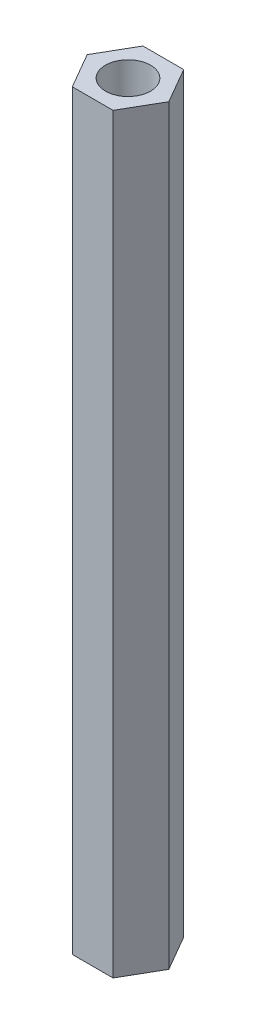
ISO-10303-21;
HEADER;
FILE_DESCRIPTION(('STEP AP214'),'2;1');
FILE_NAME('part.step','',(''),(''),'','','');
FILE_SCHEMA(('AUTOMOTIVE_DESIGN { 1 0 10303 214 1 1 1 1 }'));
ENDSEC;
DATA;
#1=APPLICATION_CONTEXT('core data for automotive mechanical design processes');
#2=APPLICATION_PROTOCOL_DEFINITION('international standard','automotive_design',2000,#1);
#3=PRODUCT_CONTEXT('',#1,'mechanical');
#4=PRODUCT('Part','Part','',(#3));
#5=PRODUCT_RELATED_PRODUCT_CATEGORY('part','',(#4));
#6=PRODUCT_DEFINITION_FORMATION('','',#4);
#7=PRODUCT_DEFINITION_CONTEXT('part definition',#1,'design');
#8=PRODUCT_DEFINITION('design','',#6,#7);
#9=PRODUCT_DEFINITION_SHAPE('','',#8);
#10=(LENGTH_UNIT() NAMED_UNIT(*) SI_UNIT(.MILLI.,.METRE.));
#11=(NAMED_UNIT(*) PLANE_ANGLE_UNIT() SI_UNIT($,.RADIAN.));
#12=(NAMED_UNIT(*) SI_UNIT($,.STERADIAN.) SOLID_ANGLE_UNIT());
#13=UNCERTAINTY_MEASURE_WITH_UNIT(LENGTH_MEASURE(1.E-05),#10,'distance_accuracy_value','');
#14=(GEOMETRIC_REPRESENTATION_CONTEXT(3) GLOBAL_UNCERTAINTY_ASSIGNED_CONTEXT((#13)) GLOBAL_UNIT_ASSIGNED_CONTEXT((#10,
#11,#12)) REPRESENTATION_CONTEXT('',''));
#15=CARTESIAN_POINT('',(0.,0.,0.));
#16=DIRECTION('',(0.,0.,1.));
#17=DIRECTION('',(1.,0.,0.));
#18=AXIS2_PLACEMENT_3D('',#15,#16,#17);
#19=CARTESIAN_POINT('',(0.,50.,0.));
#20=DIRECTION('',(0.,1.,0.));
#21=DIRECTION('',(0.,0.,1.));
#22=AXIS2_PLACEMENT_3D('',#19,#20,#21);
#23=PLANE('',#22);
#24=DIRECTION('',(0.499999999999985,0.,-0.866025403784447));
#25=VECTOR('',#24,1.);
#26=CARTESIAN_POINT('',(1.35677313259566,50.,2.35000000000002));
#27=LINE('',#26,#25);
#28=CARTESIAN_POINT('',(1.35677313259566,50.,2.35000000000002));
#29=VERTEX_POINT('',#28);
#30=CARTESIAN_POINT('',(2.71354626519124,50.,0.));
#31=VERTEX_POINT('',#30);
#32=EDGE_CURVE('E128',#29,#31,#27,.T.);
#33=ORIENTED_EDGE('',*,*,#32,.T.);
#34=DIRECTION('',(-0.500000000000015,0.,-0.86602540378443));
#35=VECTOR('',#34,1.);
#36=CARTESIAN_POINT('',(2.71354626519124,50.,0.));
#37=LINE('',#36,#35);
#38=CARTESIAN_POINT('',(1.35677313259558,50.,-2.34999999999998));
#39=VERTEX_POINT('',#38);
#40=EDGE_CURVE('E86',#31,#39,#37,.T.);
#41=ORIENTED_EDGE('',*,*,#40,.T.);
#42=DIRECTION('',(-1.,0.,0.));
#43=VECTOR('',#42,1.);
#44=CARTESIAN_POINT('',(1.35677313259558,50.,-2.34999999999998));
#45=LINE('',#44,#43);
#46=CARTESIAN_POINT('',(-1.35677313259566,50.,-2.34999999999994));
#47=VERTEX_POINT('',#46);
#48=EDGE_CURVE('E99',#39,#47,#45,.T.);
#49=ORIENTED_EDGE('',*,*,#48,.T.);
#50=DIRECTION('',(-0.499999999999985,0.,0.866025403784447));
#51=VECTOR('',#50,1.);
#52=CARTESIAN_POINT('',(-1.35677313259566,50.,-2.34999999999994));
#53=LINE('',#52,#51);
#54=CARTESIAN_POINT('',(-2.71354626519124,50.,0.));
#55=VERTEX_POINT('',#54);
#56=EDGE_CURVE('E93',#47,#55,#53,.T.);
#57=ORIENTED_EDGE('',*,*,#56,.T.);
#58=DIRECTION('',(0.500000000000015,0.,0.86602540378443));
#59=VECTOR('',#58,1.);
#60=CARTESIAN_POINT('',(-2.71354626519124,50.,0.));
#61=LINE('',#60,#59);
#62=CARTESIAN_POINT('',(-1.35677313259558,50.,2.35000000000006));
#63=VERTEX_POINT('',#62);
#64=EDGE_CURVE('E97',#55,#63,#61,.T.);
#65=ORIENTED_EDGE('',*,*,#64,.T.);
#66=DIRECTION('',(1.,0.,0.));
#67=VECTOR('',#66,1.);
#68=CARTESIAN_POINT('',(-1.35677313259558,50.,2.35000000000006));
#69=LINE('',#68,#67);
#70=EDGE_CURVE('E49',#63,#29,#69,.T.);
#71=ORIENTED_EDGE('',*,*,#70,.T.);
#72=EDGE_LOOP('',(#33,#41,#49,#57,#65,#71));
#73=FACE_BOUND('',#72,.T.);
#74=CARTESIAN_POINT('',(0.,50.,0.));
#75=DIRECTION('',(0.,1.,0.));
#76=DIRECTION('',(0.,0.,1.));
#77=AXIS2_PLACEMENT_3D('',#74,#75,#76);
#78=CIRCLE('',#77,1.5);
#79=CARTESIAN_POINT('',(0.,50.,1.5));
#80=VERTEX_POINT('',#79);
#81=EDGE_CURVE('E121',#80,#80,#78,.T.);
#82=ORIENTED_EDGE('',*,*,#81,.F.);
#83=EDGE_LOOP('',(#82));
#84=FACE_BOUND('',#83,.T.);
#85=ADVANCED_FACE('F32',(#73,#84),#23,.T.);
#86=CARTESIAN_POINT('',(0.,0.,0.));
#87=DIRECTION('',(0.,1.,0.));
#88=DIRECTION('',(0.,0.,1.));
#89=AXIS2_PLACEMENT_3D('',#86,#87,#88);
#90=PLANE('',#89);
#91=DIRECTION('',(0.499999999999985,0.,-0.866025403784447));
#92=VECTOR('',#91,1.);
#93=CARTESIAN_POINT('',(1.35677313259566,0.,2.35000000000002));
#94=LINE('',#93,#92);
#95=CARTESIAN_POINT('',(1.35677313259566,0.,2.35000000000002));
#96=VERTEX_POINT('',#95);
#97=CARTESIAN_POINT('',(2.71354626519124,0.,0.));
#98=VERTEX_POINT('',#97);
#99=EDGE_CURVE('E117',#96,#98,#94,.T.);
#100=ORIENTED_EDGE('',*,*,#99,.F.);
#101=DIRECTION('',(1.,0.,0.));
#102=VECTOR('',#101,1.);
#103=CARTESIAN_POINT('',(-1.35677313259558,0.,2.35000000000006));
#104=LINE('',#103,#102);
#105=CARTESIAN_POINT('',(-1.35677313259558,0.,2.35000000000006));
#106=VERTEX_POINT('',#105);
#107=EDGE_CURVE('E78',#106,#96,#104,.T.);
#108=ORIENTED_EDGE('',*,*,#107,.F.);
#109=DIRECTION('',(0.500000000000015,0.,0.86602540378443));
#110=VECTOR('',#109,1.);
#111=CARTESIAN_POINT('',(-2.71354626519124,0.,0.));
#112=LINE('',#111,#110);
#113=CARTESIAN_POINT('',(-2.71354626519124,0.,0.));
#114=VERTEX_POINT('',#113);
#115=EDGE_CURVE('E72',#114,#106,#112,.T.);
#116=ORIENTED_EDGE('',*,*,#115,.F.);
#117=DIRECTION('',(-0.499999999999985,0.,0.866025403784447));
#118=VECTOR('',#117,1.);
#119=CARTESIAN_POINT('',(-1.35677313259566,0.,-2.34999999999994));
#120=LINE('',#119,#118);
#121=CARTESIAN_POINT('',(-1.35677313259566,0.,-2.34999999999994));
#122=VERTEX_POINT('',#121);
#123=EDGE_CURVE('E107',#122,#114,#120,.T.);
#124=ORIENTED_EDGE('',*,*,#123,.F.);
#125=DIRECTION('',(-1.,0.,0.));
#126=VECTOR('',#125,1.);
#127=CARTESIAN_POINT('',(1.35677313259558,0.,-2.34999999999998));
#128=LINE('',#127,#126);
#129=CARTESIAN_POINT('',(1.35677313259558,0.,-2.34999999999998));
#130=VERTEX_POINT('',#129);
#131=EDGE_CURVE('E123',#130,#122,#128,.T.);
#132=ORIENTED_EDGE('',*,*,#131,.F.);
#133=DIRECTION('',(-0.500000000000015,0.,-0.86602540378443));
#134=VECTOR('',#133,1.);
#135=CARTESIAN_POINT('',(2.71354626519124,0.,0.));
#136=LINE('',#135,#134);
#137=EDGE_CURVE('E120',#98,#130,#136,.T.);
#138=ORIENTED_EDGE('',*,*,#137,.F.);
#139=EDGE_LOOP('',(#100,#108,#116,#124,#132,#138));
#140=FACE_BOUND('',#139,.T.);
#141=CARTESIAN_POINT('',(0.,0.,0.));
#142=DIRECTION('',(0.,1.,0.));
#143=DIRECTION('',(0.,0.,1.));
#144=AXIS2_PLACEMENT_3D('',#141,#142,#143);
#145=CIRCLE('',#144,1.5);
#146=CARTESIAN_POINT('',(0.,0.,1.5));
#147=VERTEX_POINT('',#146);
#148=EDGE_CURVE('E221',#147,#147,#145,.T.);
#149=ORIENTED_EDGE('',*,*,#148,.T.);
#150=EDGE_LOOP('',(#149));
#151=FACE_BOUND('',#150,.T.);
#152=ADVANCED_FACE('F137',(#140,#151),#90,.F.);
#153=CARTESIAN_POINT('',(1.35677313259566,50.,2.35000000000002));
#154=DIRECTION('',(-0.866025403784447,0.,-0.499999999999985));
#155=DIRECTION('',(-0.499999999999985,0.,0.866025403784447));
#156=AXIS2_PLACEMENT_3D('',#153,#154,#155);
#157=PLANE('',#156);
#158=ORIENTED_EDGE('',*,*,#99,.T.);
#159=DIRECTION('',(0.,-1.,0.));
#160=VECTOR('',#159,1.);
#161=CARTESIAN_POINT('',(2.71354626519124,50.,0.));
#162=LINE('',#161,#160);
#163=EDGE_CURVE('E11',#31,#98,#162,.T.);
#164=ORIENTED_EDGE('',*,*,#163,.F.);
#165=ORIENTED_EDGE('',*,*,#32,.F.);
#166=DIRECTION('',(0.,-1.,0.));
#167=VECTOR('',#166,1.);
#168=CARTESIAN_POINT('',(1.35677313259566,50.,2.35000000000002));
#169=LINE('',#168,#167);
#170=EDGE_CURVE('E113',#29,#96,#169,.T.);
#171=ORIENTED_EDGE('',*,*,#170,.T.);
#172=EDGE_LOOP('',(#158,#164,#165,#171));
#173=FACE_BOUND('',#172,.T.);
#174=ADVANCED_FACE('F34',(#173),#157,.F.);
#175=CARTESIAN_POINT('',(2.71354626519124,50.,0.));
#176=DIRECTION('',(-0.86602540378443,0.,0.500000000000015));
#177=DIRECTION('',(0.500000000000015,0.,0.86602540378443));
#178=AXIS2_PLACEMENT_3D('',#175,#176,#177);
#179=PLANE('',#178);
#180=ORIENTED_EDGE('',*,*,#137,.T.);
#181=DIRECTION('',(0.,-1.,0.));
#182=VECTOR('',#181,1.);
#183=CARTESIAN_POINT('',(1.35677313259558,50.,-2.34999999999998));
#184=LINE('',#183,#182);
#185=EDGE_CURVE('E41',#39,#130,#184,.T.);
#186=ORIENTED_EDGE('',*,*,#185,.F.);
#187=ORIENTED_EDGE('',*,*,#40,.F.);
#188=ORIENTED_EDGE('',*,*,#163,.T.);
#189=EDGE_LOOP('',(#180,#186,#187,#188));
#190=FACE_BOUND('',#189,.T.);
#191=ADVANCED_FACE('F162',(#190),#179,.F.);
#192=CARTESIAN_POINT('',(1.35677313259558,50.,-2.34999999999998));
#193=DIRECTION('',(0.,0.,1.));
#194=DIRECTION('',(1.,0.,0.));
#195=AXIS2_PLACEMENT_3D('',#192,#193,#194);
#196=PLANE('',#195);
#197=ORIENTED_EDGE('',*,*,#131,.T.);
#198=DIRECTION('',(0.,-1.,0.));
#199=VECTOR('',#198,1.);
#200=CARTESIAN_POINT('',(-1.35677313259566,50.,-2.34999999999994));
#201=LINE('',#200,#199);
#202=EDGE_CURVE('E108',#47,#122,#201,.T.);
#203=ORIENTED_EDGE('',*,*,#202,.F.);
#204=ORIENTED_EDGE('',*,*,#48,.F.);
#205=ORIENTED_EDGE('',*,*,#185,.T.);
#206=EDGE_LOOP('',(#197,#203,#204,#205));
#207=FACE_BOUND('',#206,.T.);
#208=ADVANCED_FACE('F134',(#207),#196,.F.);
#209=CARTESIAN_POINT('',(-1.35677313259566,50.,-2.34999999999994));
#210=DIRECTION('',(0.866025403784447,0.,0.499999999999985));
#211=DIRECTION('',(0.499999999999985,0.,-0.866025403784447));
#212=AXIS2_PLACEMENT_3D('',#209,#210,#211);
#213=PLANE('',#212);
#214=ORIENTED_EDGE('',*,*,#123,.T.);
#215=DIRECTION('',(0.,-1.,0.));
#216=VECTOR('',#215,1.);
#217=CARTESIAN_POINT('',(-2.71354626519124,50.,0.));
#218=LINE('',#217,#216);
#219=EDGE_CURVE('E104',#55,#114,#218,.T.);
#220=ORIENTED_EDGE('',*,*,#219,.F.);
#221=ORIENTED_EDGE('',*,*,#56,.F.);
#222=ORIENTED_EDGE('',*,*,#202,.T.);
#223=EDGE_LOOP('',(#214,#220,#221,#222));
#224=FACE_BOUND('',#223,.T.);
#225=ADVANCED_FACE('F105',(#224),#213,.F.);
#226=CARTESIAN_POINT('',(-2.71354626519124,50.,0.));
#227=DIRECTION('',(0.86602540378443,0.,-0.500000000000015));
#228=DIRECTION('',(-0.500000000000015,0.,-0.86602540378443));
#229=AXIS2_PLACEMENT_3D('',#226,#227,#228);
#230=PLANE('',#229);
#231=ORIENTED_EDGE('',*,*,#115,.T.);
#232=DIRECTION('',(0.,-1.,0.));
#233=VECTOR('',#232,1.);
#234=CARTESIAN_POINT('',(-1.35677313259558,50.,2.35000000000006));
#235=LINE('',#234,#233);
#236=EDGE_CURVE('E109',#63,#106,#235,.T.);
#237=ORIENTED_EDGE('',*,*,#236,.F.);
#238=ORIENTED_EDGE('',*,*,#64,.F.);
#239=ORIENTED_EDGE('',*,*,#219,.T.);
#240=EDGE_LOOP('',(#231,#237,#238,#239));
#241=FACE_BOUND('',#240,.T.);
#242=ADVANCED_FACE('F111',(#241),#230,.F.);
#243=CARTESIAN_POINT('',(-1.35677313259558,50.,2.35000000000006));
#244=DIRECTION('',(0.,0.,-1.));
#245=DIRECTION('',(-1.,0.,0.));
#246=AXIS2_PLACEMENT_3D('',#243,#244,#245);
#247=PLANE('',#246);
#248=ORIENTED_EDGE('',*,*,#107,.T.);
#249=ORIENTED_EDGE('',*,*,#170,.F.);
#250=ORIENTED_EDGE('',*,*,#70,.F.);
#251=ORIENTED_EDGE('',*,*,#236,.T.);
#252=EDGE_LOOP('',(#248,#249,#250,#251));
#253=FACE_BOUND('',#252,.T.);
#254=ADVANCED_FACE('F142',(#253),#247,.F.);
#255=CARTESIAN_POINT('',(0.,50.,0.));
#256=DIRECTION('',(0.,-1.,0.));
#257=DIRECTION('',(0.,0.,-1.));
#258=AXIS2_PLACEMENT_3D('',#255,#256,#257);
#259=CYLINDRICAL_SURFACE('',#258,1.5);
#260=ORIENTED_EDGE('',*,*,#81,.T.);
#261=EDGE_LOOP('',(#260));
#262=FACE_BOUND('',#261,.T.);
#263=ORIENTED_EDGE('',*,*,#148,.F.);
#264=EDGE_LOOP('',(#263));
#265=FACE_BOUND('',#264,.T.);
#266=ADVANCED_FACE('F144',(#262,#265),#259,.F.);
#267=CLOSED_SHELL('',(#85,#152,#174,#191,#208,#225,#242,#254,#266));
#268=MANIFOLD_SOLID_BREP('B2',#267);
#269=ADVANCED_BREP_SHAPE_REPRESENTATION('',(#18,#268),#14);
#270=SHAPE_DEFINITION_REPRESENTATION(#9,#269);
ENDSEC;
END-ISO-10303-21;
